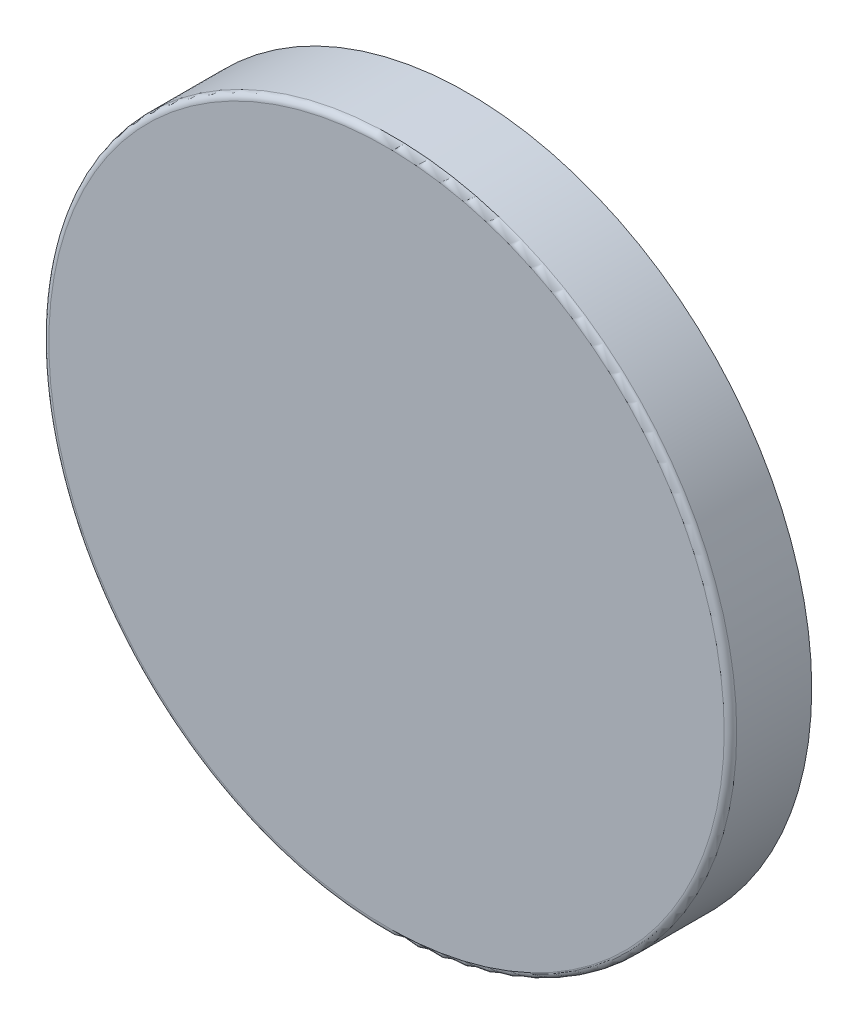
ISO-10303-21;
HEADER;
FILE_DESCRIPTION(('STEP AP214'),'2;1');
FILE_NAME('part.step','',(''),(''),'','','');
FILE_SCHEMA(('AUTOMOTIVE_DESIGN { 1 0 10303 214 1 1 1 1 }'));
ENDSEC;
DATA;
#1=APPLICATION_CONTEXT('core data for automotive mechanical design processes');
#2=APPLICATION_PROTOCOL_DEFINITION('international standard','automotive_design',2000,#1);
#3=PRODUCT_CONTEXT('',#1,'mechanical');
#4=PRODUCT('Part','Part','',(#3));
#5=PRODUCT_RELATED_PRODUCT_CATEGORY('part','',(#4));
#6=PRODUCT_DEFINITION_FORMATION('','',#4);
#7=PRODUCT_DEFINITION_CONTEXT('part definition',#1,'design');
#8=PRODUCT_DEFINITION('design','',#6,#7);
#9=PRODUCT_DEFINITION_SHAPE('','',#8);
#10=(LENGTH_UNIT() NAMED_UNIT(*) SI_UNIT(.MILLI.,.METRE.));
#11=(NAMED_UNIT(*) PLANE_ANGLE_UNIT() SI_UNIT($,.RADIAN.));
#12=(NAMED_UNIT(*) SI_UNIT($,.STERADIAN.) SOLID_ANGLE_UNIT());
#13=UNCERTAINTY_MEASURE_WITH_UNIT(LENGTH_MEASURE(1.E-05),#10,'distance_accuracy_value','');
#14=(GEOMETRIC_REPRESENTATION_CONTEXT(3) GLOBAL_UNCERTAINTY_ASSIGNED_CONTEXT((#13)) GLOBAL_UNIT_ASSIGNED_CONTEXT((#10,
#11,#12)) REPRESENTATION_CONTEXT('',''));
#15=CARTESIAN_POINT('',(0.,0.,0.));
#16=DIRECTION('',(0.,0.,1.));
#17=DIRECTION('',(1.,0.,0.));
#18=AXIS2_PLACEMENT_3D('',#15,#16,#17);
#19=CARTESIAN_POINT('',(0.,0.,13.));
#20=DIRECTION('',(0.,0.,-1.));
#21=DIRECTION('',(-1.,0.,0.));
#22=AXIS2_PLACEMENT_3D('',#19,#20,#21);
#23=CYLINDRICAL_SURFACE('',#22,55.);
#24=CARTESIAN_POINT('',(0.,0.,12.));
#25=DIRECTION('',(0.,0.,1.));
#26=DIRECTION('',(1.,0.,0.));
#27=AXIS2_PLACEMENT_3D('',#24,#25,#26);
#28=CIRCLE('',#27,55.);
#29=CARTESIAN_POINT('',(55.,0.,12.));
#30=VERTEX_POINT('',#29);
#31=EDGE_CURVE('E10',#30,#30,#28,.F.);
#32=ORIENTED_EDGE('',*,*,#31,.T.);
#33=EDGE_LOOP('',(#32));
#34=FACE_BOUND('',#33,.T.);
#35=CARTESIAN_POINT('',(0.,0.,0.));
#36=DIRECTION('',(0.,0.,1.));
#37=DIRECTION('',(1.,0.,0.));
#38=AXIS2_PLACEMENT_3D('',#35,#36,#37);
#39=CIRCLE('',#38,55.);
#40=CARTESIAN_POINT('',(55.,0.,0.));
#41=VERTEX_POINT('',#40);
#42=EDGE_CURVE('E41',#41,#41,#39,.T.);
#43=ORIENTED_EDGE('',*,*,#42,.T.);
#44=EDGE_LOOP('',(#43));
#45=FACE_BOUND('',#44,.T.);
#46=ADVANCED_FACE('F30',(#34,#45),#23,.T.);
#47=CARTESIAN_POINT('',(0.,0.,13.));
#48=DIRECTION('',(0.,0.,1.));
#49=DIRECTION('',(1.,0.,0.));
#50=AXIS2_PLACEMENT_3D('',#47,#48,#49);
#51=PLANE('',#50);
#52=CARTESIAN_POINT('',(0.,0.,13.));
#53=DIRECTION('',(0.,0.,1.));
#54=DIRECTION('',(1.,0.,0.));
#55=AXIS2_PLACEMENT_3D('',#52,#53,#54);
#56=CIRCLE('',#55,54.);
#57=CARTESIAN_POINT('',(54.,0.,13.));
#58=VERTEX_POINT('',#57);
#59=EDGE_CURVE('E37',#58,#58,#56,.T.);
#60=ORIENTED_EDGE('',*,*,#59,.T.);
#61=EDGE_LOOP('',(#60));
#62=FACE_BOUND('',#61,.T.);
#63=ADVANCED_FACE('F51',(#62),#51,.T.);
#64=CARTESIAN_POINT('',(0.,0.,0.));
#65=DIRECTION('',(0.,0.,1.));
#66=DIRECTION('',(1.,0.,0.));
#67=AXIS2_PLACEMENT_3D('',#64,#65,#66);
#68=PLANE('',#67);
#69=ORIENTED_EDGE('',*,*,#42,.F.);
#70=EDGE_LOOP('',(#69));
#71=FACE_BOUND('',#70,.T.);
#72=ADVANCED_FACE('F49',(#71),#68,.F.);
#73=CARTESIAN_POINT('',(0.,0.,12.));
#74=DIRECTION('',(0.,0.,1.));
#75=DIRECTION('',(1.,0.,0.));
#76=AXIS2_PLACEMENT_3D('',#73,#74,#75);
#77=TOROIDAL_SURFACE('',#76,54.,1.);
#78=ORIENTED_EDGE('',*,*,#31,.F.);
#79=EDGE_LOOP('',(#78));
#80=FACE_BOUND('',#79,.T.);
#81=ORIENTED_EDGE('',*,*,#59,.F.);
#82=EDGE_LOOP('',(#81));
#83=FACE_BOUND('',#82,.T.);
#84=ADVANCED_FACE('F32',(#80,#83),#77,.T.);
#85=CLOSED_SHELL('',(#46,#63,#72,#84));
#86=MANIFOLD_SOLID_BREP('B2',#85);
#87=ADVANCED_BREP_SHAPE_REPRESENTATION('',(#18,#86),#14);
#88=SHAPE_DEFINITION_REPRESENTATION(#9,#87);
ENDSEC;
END-ISO-10303-21;
